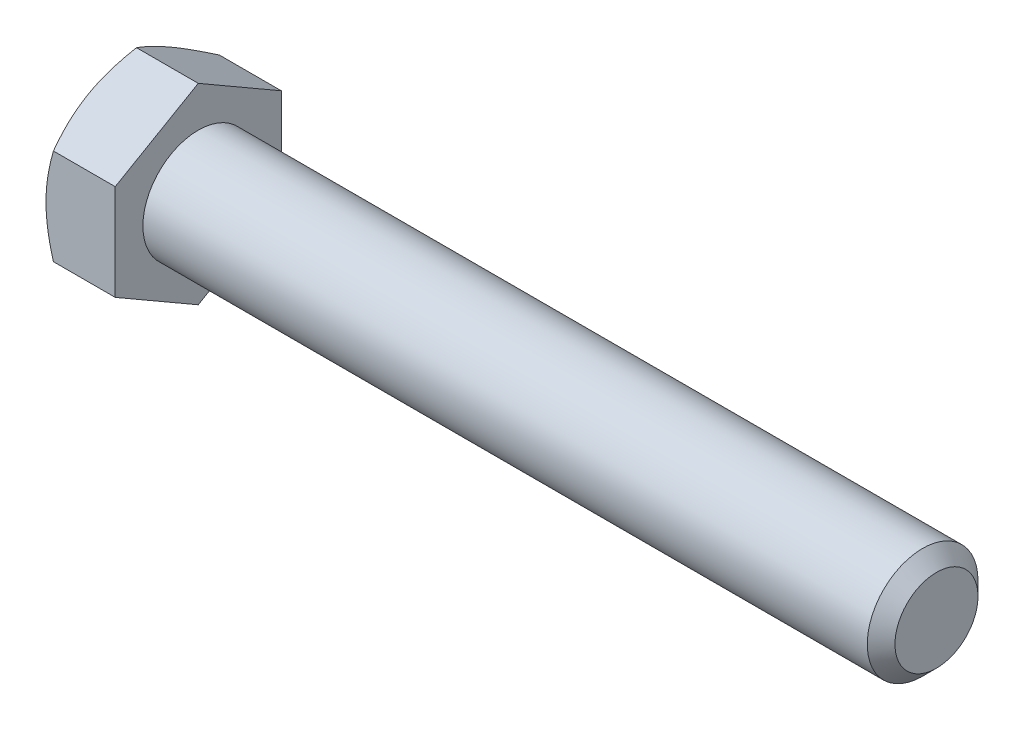
ISO-10303-21;
HEADER;
FILE_DESCRIPTION(('STEP AP214'),'2;1');
FILE_NAME('part.step','',(''),(''),'','','');
FILE_SCHEMA(('AUTOMOTIVE_DESIGN { 1 0 10303 214 1 1 1 1 }'));
ENDSEC;
DATA;
#1=APPLICATION_CONTEXT('core data for automotive mechanical design processes');
#2=APPLICATION_PROTOCOL_DEFINITION('international standard','automotive_design',2000,#1);
#3=PRODUCT_CONTEXT('',#1,'mechanical');
#4=PRODUCT('Part','Part','',(#3));
#5=PRODUCT_RELATED_PRODUCT_CATEGORY('part','',(#4));
#6=PRODUCT_DEFINITION_FORMATION('','',#4);
#7=PRODUCT_DEFINITION_CONTEXT('part definition',#1,'design');
#8=PRODUCT_DEFINITION('design','',#6,#7);
#9=PRODUCT_DEFINITION_SHAPE('','',#8);
#10=(LENGTH_UNIT() NAMED_UNIT(*) SI_UNIT(.MILLI.,.METRE.));
#11=(NAMED_UNIT(*) PLANE_ANGLE_UNIT() SI_UNIT($,.RADIAN.));
#12=(NAMED_UNIT(*) SI_UNIT($,.STERADIAN.) SOLID_ANGLE_UNIT());
#13=UNCERTAINTY_MEASURE_WITH_UNIT(LENGTH_MEASURE(1.E-05),#10,'distance_accuracy_value','');
#14=(GEOMETRIC_REPRESENTATION_CONTEXT(3) GLOBAL_UNCERTAINTY_ASSIGNED_CONTEXT((#13)) GLOBAL_UNIT_ASSIGNED_CONTEXT((#10,
#11,#12)) REPRESENTATION_CONTEXT('',''));
#15=CARTESIAN_POINT('',(0.,0.,0.));
#16=DIRECTION('',(0.,0.,1.));
#17=DIRECTION('',(1.,0.,0.));
#18=AXIS2_PLACEMENT_3D('',#15,#16,#17);
#19=CARTESIAN_POINT('',(-34.7265625,-4.12444598552339,7.14375));
#20=DIRECTION('',(0.,0.,-1.));
#21=DIRECTION('',(0.,1.,0.));
#22=AXIS2_PLACEMENT_3D('',#19,#20,#21);
#23=PLANE('',#22);
#24=CARTESIAN_POINT('',(-31.1489865517299,-11.2663331010321,7.14375000000001));
#25=CARTESIAN_POINT('',(-31.3018916093406,-10.9526585260789,7.14375000000001));
#26=CARTESIAN_POINT('',(-31.4533836933832,-10.6382836542767,7.14375000000001));
#27=CARTESIAN_POINT('',(-31.7527506821812,-10.0077615017905,7.14375000000001));
#28=CARTESIAN_POINT('',(-31.900625051226,-9.69161396702917,7.14375000000001));
#29=CARTESIAN_POINT('',(-32.1926695049596,-9.05563439196275,7.14375000000001));
#30=CARTESIAN_POINT('',(-32.3368166072603,-8.7357917628463,7.14375));
#31=CARTESIAN_POINT('',(-32.6194560800926,-8.09362699677256,7.14375));
#32=CARTESIAN_POINT('',(-32.7579487059739,-7.77130497256489,7.14375));
#33=CARTESIAN_POINT('',(-33.0323843112182,-7.1126477319264,7.14375));
#34=CARTESIAN_POINT('',(-33.1680800725103,-6.7762089572775,7.14375));
#35=CARTESIAN_POINT('',(-33.4296484442764,-6.09946617006707,7.14375));
#36=CARTESIAN_POINT('',(-33.5555199792837,-5.75916173898678,7.14375));
#37=CARTESIAN_POINT('',(-33.7942725000117,-5.07472029068008,7.14375));
#38=CARTESIAN_POINT('',(-33.9071782225713,-4.73059199311039,7.14375));
#39=CARTESIAN_POINT('',(-34.1165021446484,-4.03741473671194,7.14375));
#40=CARTESIAN_POINT('',(-34.212925341419,-3.68836730415507,7.14375));
#41=CARTESIAN_POINT('',(-34.3842652218286,-2.9870309318954,7.14375));
#42=CARTESIAN_POINT('',(-34.4593028627481,-2.63477234319657,7.14375));
#43=CARTESIAN_POINT('',(-34.5526618681374,-2.1030318667931,7.14375));
#44=CARTESIAN_POINT('',(-34.5805831510448,-1.92521461219623,7.14375));
#45=CARTESIAN_POINT('',(-34.629483904889,-1.56863481744089,7.14375));
#46=CARTESIAN_POINT('',(-34.6504640840297,-1.38987237561235,7.14375));
#47=CARTESIAN_POINT('',(-34.6847915139766,-1.03405772350562,7.14375));
#48=CARTESIAN_POINT('',(-34.698238339965,-0.857015161272195,7.14375));
#49=CARTESIAN_POINT('',(-34.7176257148482,-0.502519392820489,7.14375));
#50=CARTESIAN_POINT('',(-34.7235663937634,-0.325066193768542,7.14375));
#51=CARTESIAN_POINT('',(-34.7277989006282,0.0299339885928097,7.14375));
#52=CARTESIAN_POINT('',(-34.7260906897341,0.20748097237391,7.14375));
#53=CARTESIAN_POINT('',(-34.7150691489848,0.562340717238556,7.14375));
#54=CARTESIAN_POINT('',(-34.7057554747302,0.739653467351053,7.14375));
#55=CARTESIAN_POINT('',(-34.6748499974433,1.1601668545907,7.14375));
#56=CARTESIAN_POINT('',(-34.6499628496378,1.4031309251268,7.14375));
#57=CARTESIAN_POINT('',(-34.5872243960987,1.88736608979616,7.14375));
#58=CARTESIAN_POINT('',(-34.5493714865831,2.12863697072332,7.14375));
#59=CARTESIAN_POINT('',(-34.4183623824147,2.84956516438006,7.14375));
#60=CARTESIAN_POINT('',(-34.3077754642688,3.32610304841376,7.14375));
#61=CARTESIAN_POINT('',(-34.114565685271,4.03906159746148,7.14375));
#62=CARTESIAN_POINT('',(-34.0446450141952,4.27913814009048,7.14375));
#63=CARTESIAN_POINT('',(-33.8971844861915,4.75696290725822,7.14375));
#64=CARTESIAN_POINT('',(-33.8196445699351,4.99471111365116,7.14375));
#65=CARTESIAN_POINT('',(-33.6582190818296,5.46794997375842,7.14375));
#66=CARTESIAN_POINT('',(-33.5743352662682,5.70344123210712,7.14375));
#67=CARTESIAN_POINT('',(-33.4012445304531,6.17244640298572,7.14375));
#68=CARTESIAN_POINT('',(-33.3120377360633,6.40596036212067,7.14375));
#69=CARTESIAN_POINT('',(-33.0633604489421,7.03872191278711,7.14375));
#70=CARTESIAN_POINT('',(-32.8995400056044,7.43625841265707,7.14375));
#71=CARTESIAN_POINT('',(-32.5621568215763,8.2271912520003,7.14375));
#72=CARTESIAN_POINT('',(-32.3885929635018,8.62058711045248,7.14375));
#73=CARTESIAN_POINT('',(-32.0340472006189,9.40419829395571,7.14375));
#74=CARTESIAN_POINT('',(-31.8530623825817,9.79441229643382,7.14375));
#75=CARTESIAN_POINT('',(-31.4854644281557,10.5721508036745,7.14375));
#76=CARTESIAN_POINT('',(-31.2988515295787,10.959675421227,7.14375));
#77=CARTESIAN_POINT('',(-30.9209213608003,11.7332086856002,7.14375));
#78=CARTESIAN_POINT('',(-30.7295968603467,12.1192137923581,7.14375));
#79=CARTESIAN_POINT('',(-30.3434574990898,12.8894754248862,7.14375));
#80=CARTESIAN_POINT('',(-30.1486426081051,13.2737319355003,7.14374999999999));
#81=CARTESIAN_POINT('',(-29.7562574761783,14.040723069246,7.14374999999999));
#82=CARTESIAN_POINT('',(-29.558687874856,14.4234580199956,7.14374999999999));
#83=CARTESIAN_POINT('',(-29.1612684682255,15.1877429148004,7.14374999999999));
#84=CARTESIAN_POINT('',(-28.9614186537239,15.5692928540703,7.14374999999999));
#85=CARTESIAN_POINT('',(-28.4020884443824,16.6308245469844,7.14374999999999));
#86=CARTESIAN_POINT('',(-28.0405657253058,17.3097299401976,7.14374999999999));
#87=CARTESIAN_POINT('',(-27.313197158883,18.665271462304,7.14374999999999));
#88=CARTESIAN_POINT('',(-26.9473510371465,19.3419074436291,7.14374999999999));
#89=CARTESIAN_POINT('',(-26.2137063339653,20.6911218826658,7.14374999999999));
#90=CARTESIAN_POINT('',(-25.8459187075418,21.3637063030919,7.14374999999999));
#91=CARTESIAN_POINT('',(-25.1078891044826,22.7074568719898,7.14374999999999));
#92=CARTESIAN_POINT('',(-24.7376473290148,23.3786231309042,7.14374999999999));
#93=CARTESIAN_POINT('',(-24.3665149893366,24.0492929513685,7.14374999999999));
#94=B_SPLINE_CURVE_WITH_KNOTS('',3,(#24,#25,#26,#27,#28,#29,#30,#31,#32,#33,#34,#35,#36,#37,#38,
#39,#40,#41,#42,#43,#44,#45,#46,#47,#48,#49,#50,#51,#52,#53,#54,#55,#56,#57,#58,#59,#60,#61,#62,
#63,#64,#65,#66,#67,#68,#69,#70,#71,#72,#73,#74,#75,#76,#77,#78,#79,#80,#81,#82,#83,#84,#85,#86,
#87,#88,#89,#90,#91,#92,#93),.UNSPECIFIED.,.F.,.F.,(4,2,2,2,2,2,2,2,2,2,2,2,2,2,2,2,2,2,2,2,2,2,
2,2,2,2,2,2,2,2,2,2,2,2,4),(0.,1.04688595028014,2.09392599627377,3.14635495835938,
4.19873634125414,5.28693671898586,6.37525605639765,7.46146327925315,8.54734059411701,
9.6269484083217,10.1668224823235,10.7066414557344,11.2391458043708,11.7716409289173,
12.3041387576714,12.8366607009574,13.5689570636593,14.3013440394724,15.7668221846809,
16.516908106481,17.2669998694032,18.0168847267454,18.7667518597876,20.0564603096399,
21.3463169678315,22.6366849229971,23.926998430468,25.2194334122655,26.5118795751235,
27.8040304818266,29.0961866000085,31.4036503446529,33.7112613304689,36.0109810500031,
38.3105145356995),.UNSPECIFIED.);
#95=CARTESIAN_POINT('',(-34.0885084855234,-4.12444598552339,7.14375));
#96=VERTEX_POINT('',#95);
#97=CARTESIAN_POINT('',(-34.7265625,0.,7.14375));
#98=VERTEX_POINT('',#97);
#99=EDGE_CURVE('E252',#96,#98,#94,.T.);
#100=ORIENTED_EDGE('',*,*,#99,.F.);
#101=DIRECTION('',(1.,0.,0.));
#102=VECTOR('',#101,1.);
#103=CARTESIAN_POINT('',(-34.7265625,-4.12444598552339,7.14375));
#104=LINE('',#103,#102);
#105=CARTESIAN_POINT('',(-28.7734375,-4.12444598552339,7.14375));
#106=VERTEX_POINT('',#105);
#107=EDGE_CURVE('E255',#96,#106,#104,.T.);
#108=ORIENTED_EDGE('',*,*,#107,.T.);
#109=DIRECTION('',(0.,1.,0.));
#110=VECTOR('',#109,1.);
#111=CARTESIAN_POINT('',(-28.7734375,-4.12444598552339,7.14375));
#112=LINE('',#111,#110);
#113=CARTESIAN_POINT('',(-28.7734375,4.12444598552339,7.14375));
#114=VERTEX_POINT('',#113);
#115=EDGE_CURVE('E257',#106,#114,#112,.T.);
#116=ORIENTED_EDGE('',*,*,#115,.T.);
#117=DIRECTION('',(1.,0.,0.));
#118=VECTOR('',#117,1.);
#119=CARTESIAN_POINT('',(-34.7265625,4.12444598552339,7.14375));
#120=LINE('',#119,#118);
#121=CARTESIAN_POINT('',(-34.0885084855234,4.12444598552339,7.14375));
#122=VERTEX_POINT('',#121);
#123=EDGE_CURVE('E225',#122,#114,#120,.T.);
#124=ORIENTED_EDGE('',*,*,#123,.F.);
#125=EDGE_CURVE('E109',#98,#122,#94,.T.);
#126=ORIENTED_EDGE('',*,*,#125,.F.);
#127=EDGE_LOOP('',(#100,#108,#116,#124,#126));
#128=FACE_BOUND('',#127,.T.);
#129=ADVANCED_FACE('F33',(#128),#23,.F.);
#130=CARTESIAN_POINT('',(-34.7265625,4.12444598552339,7.14375));
#131=DIRECTION('',(0.,-0.866025403784439,-0.5));
#132=DIRECTION('',(0.,0.5,-0.866025403784439));
#133=AXIS2_PLACEMENT_3D('',#130,#131,#132);
#134=PLANE('',#133);
#135=CARTESIAN_POINT('',(-34.0884418174569,4.12433051546955,7.14395));
#136=CARTESIAN_POINT('',(-34.14077646855,4.21499047493766,6.98692234398911));
#137=CARTESIAN_POINT('',(-34.1907359741408,4.30598845856223,6.82930921296503));
#138=CARTESIAN_POINT('',(-34.2852505324684,4.48872342670425,6.51280296382357));
#139=CARTESIAN_POINT('',(-34.3298032537979,4.58046071195489,6.35390932482102));
#140=CARTESIAN_POINT('',(-34.4544767378888,4.85714139103217,5.87468433118651));
#141=CARTESIAN_POINT('',(-34.5253895900442,5.04317693592539,5.55246131541769));
#142=CARTESIAN_POINT('',(-34.6085432614031,5.32157574305278,5.07026043670648));
#143=CARTESIAN_POINT('',(-34.6322313344435,5.41310718327031,4.91172333175978));
#144=CARTESIAN_POINT('',(-34.6719527768645,5.59658364372469,4.59393278025988));
#145=CARTESIAN_POINT('',(-34.6879868225755,5.6885286266948,4.4346793982546));
#146=CARTESIAN_POINT('',(-34.711991577991,5.87257827929426,4.11589604883692));
#147=CARTESIAN_POINT('',(-34.7199714385863,5.96468264833057,3.95636660206697));
#148=CARTESIAN_POINT('',(-34.7277052757077,6.14897138013525,3.63716915531883));
#149=CARTESIAN_POINT('',(-34.7274595063572,6.24115574034439,3.47750115977338));
#150=CARTESIAN_POINT('',(-34.7154795896088,6.49371006632156,3.04006423550959));
#151=CARTESIAN_POINT('',(-34.695368878855,6.65399735752975,2.76243850332943));
#152=CARTESIAN_POINT('',(-34.631597993257,6.97350732659354,2.20903100338617));
#153=CARTESIAN_POINT('',(-34.5879160225342,7.13272888080875,1.93325118182535));
#154=CARTESIAN_POINT('',(-34.4787239095432,7.45288184700058,1.37872997818721));
#155=CARTESIAN_POINT('',(-34.4127511381118,7.61377286233254,1.10005856515092));
#156=CARTESIAN_POINT('',(-34.2630196178419,7.93315557291967,0.546871483354956));
#157=CARTESIAN_POINT('',(-34.1792960396244,8.09165135831551,0.272348730263811));
#158=CARTESIAN_POINT('',(-34.0884418174569,8.24900744110062,-0.000200000000000877));
#159=B_SPLINE_CURVE_WITH_KNOTS('',3,(#135,#136,#137,#138,#139,#140,#141,#142,#143,#144,#145,
#146,#147,#148,#149,#150,#151,#152,#153,#154,#155,#156,#157,#158),.UNSPECIFIED.,.F.,.F.,(4,2,2,
2,2,2,2,2,2,2,2,4),(0.,0.566119481838006,1.13248221371019,2.2675610579816,2.82119915823017,
3.37478832846408,3.92774781910558,4.48069022658465,5.44329448766884,6.4067903790172,
7.39165514483023,8.37458648302853),.UNSPECIFIED.);
#160=CARTESIAN_POINT('',(-34.7265625,6.18666897828508,3.571875));
#161=VERTEX_POINT('',#160);
#162=EDGE_CURVE('E105',#122,#161,#159,.T.);
#163=ORIENTED_EDGE('',*,*,#162,.F.);
#164=ORIENTED_EDGE('',*,*,#123,.T.);
#165=DIRECTION('',(0.,0.5,-0.866025403784439));
#166=VECTOR('',#165,1.);
#167=CARTESIAN_POINT('',(-28.7734375,4.12444598552339,7.14375));
#168=LINE('',#167,#166);
#169=CARTESIAN_POINT('',(-28.7734375,8.24889197104678,0.));
#170=VERTEX_POINT('',#169);
#171=EDGE_CURVE('E275',#114,#170,#168,.T.);
#172=ORIENTED_EDGE('',*,*,#171,.T.);
#173=DIRECTION('',(1.,0.,0.));
#174=VECTOR('',#173,1.);
#175=CARTESIAN_POINT('',(-34.7265625,8.24889197104678,0.));
#176=LINE('',#175,#174);
#177=CARTESIAN_POINT('',(-34.0885084855234,8.24889197104678,0.));
#178=VERTEX_POINT('',#177);
#179=EDGE_CURVE('E128',#178,#170,#176,.T.);
#180=ORIENTED_EDGE('',*,*,#179,.F.);
#181=EDGE_CURVE('E113',#161,#178,#159,.T.);
#182=ORIENTED_EDGE('',*,*,#181,.F.);
#183=EDGE_LOOP('',(#163,#164,#172,#180,#182));
#184=FACE_BOUND('',#183,.T.);
#185=ADVANCED_FACE('F126',(#184),#134,.F.);
#186=CARTESIAN_POINT('',(-34.7265625,8.24889197104678,0.));
#187=DIRECTION('',(0.,-0.866025403784439,0.5));
#188=DIRECTION('',(0.,-0.5,-0.866025403784439));
#189=AXIS2_PLACEMENT_3D('',#186,#187,#188);
#190=PLANE('',#189);
#191=CARTESIAN_POINT('',(-34.0884418174569,8.24900744110062,0.000199999999999568));
#192=CARTESIAN_POINT('',(-34.14077646855,8.15834748163251,-0.156827656010893));
#193=CARTESIAN_POINT('',(-34.1907359741408,8.06734949800794,-0.314440787034966));
#194=CARTESIAN_POINT('',(-34.2852505324684,7.88461452986592,-0.630947036176425));
#195=CARTESIAN_POINT('',(-34.3298032537979,7.79287724461528,-0.789840675178983));
#196=CARTESIAN_POINT('',(-34.4544767378888,7.516196565538,-1.26906566881349));
#197=CARTESIAN_POINT('',(-34.5253895900442,7.33016102064478,-1.59128868458231));
#198=CARTESIAN_POINT('',(-34.6085432614031,7.05176221351739,-2.07348956329352));
#199=CARTESIAN_POINT('',(-34.6322313344435,6.96023077329986,-2.23202666824022));
#200=CARTESIAN_POINT('',(-34.6719527768645,6.77675431284548,-2.54981721974012));
#201=CARTESIAN_POINT('',(-34.6879868225755,6.68480932987537,-2.7090706017454));
#202=CARTESIAN_POINT('',(-34.711991577991,6.50075967727591,-3.02785395116308));
#203=CARTESIAN_POINT('',(-34.7199714385863,6.4086553082396,-3.18738339793303));
#204=CARTESIAN_POINT('',(-34.7277052757077,6.22436657643492,-3.50658084468117));
#205=CARTESIAN_POINT('',(-34.7274595063572,6.13218221622578,-3.66624884022662));
#206=CARTESIAN_POINT('',(-34.7154795896088,5.87962789024861,-4.10368576449041));
#207=CARTESIAN_POINT('',(-34.695368878855,5.71934059904042,-4.38131149667057));
#208=CARTESIAN_POINT('',(-34.631597993257,5.39983062997663,-4.93471899661383));
#209=CARTESIAN_POINT('',(-34.5879160225342,5.24060907576142,-5.21049881817465));
#210=CARTESIAN_POINT('',(-34.4787239095432,4.92045610956958,-5.76502002181279));
#211=CARTESIAN_POINT('',(-34.4127511381118,4.75956509423763,-6.04369143484908));
#212=CARTESIAN_POINT('',(-34.2630196178419,4.4401823836505,-6.59687851664504));
#213=CARTESIAN_POINT('',(-34.1792960396244,4.28168659825465,-6.87140126973619));
#214=CARTESIAN_POINT('',(-34.0884418174569,4.12433051546955,-7.14395));
#215=B_SPLINE_CURVE_WITH_KNOTS('',3,(#191,#192,#193,#194,#195,#196,#197,#198,#199,#200,#201,
#202,#203,#204,#205,#206,#207,#208,#209,#210,#211,#212,#213,#214),.UNSPECIFIED.,.F.,.F.,(4,2,2,
2,2,2,2,2,2,2,2,4),(0.,0.566119481838006,1.13248221371019,2.2675610579816,2.82119915823017,
3.37478832846408,3.92774781910558,4.48069022658465,5.44329448766884,6.4067903790172,
7.39165514483023,8.37458648302854),.UNSPECIFIED.);
#216=CARTESIAN_POINT('',(-34.7265625,6.18666897828508,-3.571875));
#217=VERTEX_POINT('',#216);
#218=EDGE_CURVE('E118',#178,#217,#215,.T.);
#219=ORIENTED_EDGE('',*,*,#218,.F.);
#220=ORIENTED_EDGE('',*,*,#179,.T.);
#221=DIRECTION('',(0.,-0.5,-0.866025403784439));
#222=VECTOR('',#221,1.);
#223=CARTESIAN_POINT('',(-28.7734375,8.24889197104678,0.));
#224=LINE('',#223,#222);
#225=CARTESIAN_POINT('',(-28.7734375,4.12444598552339,-7.14375));
#226=VERTEX_POINT('',#225);
#227=EDGE_CURVE('E272',#170,#226,#224,.T.);
#228=ORIENTED_EDGE('',*,*,#227,.T.);
#229=DIRECTION('',(1.,0.,0.));
#230=VECTOR('',#229,1.);
#231=CARTESIAN_POINT('',(-34.7265625,4.12444598552339,-7.14375));
#232=LINE('',#231,#230);
#233=CARTESIAN_POINT('',(-34.0885084855234,4.12444598552339,-7.14375));
#234=VERTEX_POINT('',#233);
#235=EDGE_CURVE('E269',#234,#226,#232,.T.);
#236=ORIENTED_EDGE('',*,*,#235,.F.);
#237=EDGE_CURVE('E129',#217,#234,#215,.T.);
#238=ORIENTED_EDGE('',*,*,#237,.F.);
#239=EDGE_LOOP('',(#219,#220,#228,#236,#238));
#240=FACE_BOUND('',#239,.T.);
#241=ADVANCED_FACE('F189',(#240),#190,.F.);
#242=CARTESIAN_POINT('',(-34.7265625,4.12444598552339,-7.14375));
#243=DIRECTION('',(0.,0.,1.));
#244=DIRECTION('',(0.,-1.,0.));
#245=AXIS2_PLACEMENT_3D('',#242,#243,#244);
#246=PLANE('',#245);
#247=CARTESIAN_POINT('',(-31.1489865559728,-11.2663330923302,-7.14375));
#248=CARTESIAN_POINT('',(-31.3018916134069,-10.95265851767,-7.14375));
#249=CARTESIAN_POINT('',(-31.4533836972729,-10.6382836461611,-7.14375));
#250=CARTESIAN_POINT('',(-31.7527506857185,-10.0077614942623,-7.14375));
#251=CARTESIAN_POINT('',(-31.9006250545876,-9.69161395979511,-7.14375));
#252=CARTESIAN_POINT('',(-32.1926695079696,-9.05563438532138,-7.14375));
#253=CARTESIAN_POINT('',(-32.3368166100945,-8.73579175650347,-7.14375));
#254=CARTESIAN_POINT('',(-32.6194560825781,-8.09362699102884,-7.14375));
#255=CARTESIAN_POINT('',(-32.7579487082865,-7.77130496712173,-7.14375));
#256=CARTESIAN_POINT('',(-33.0323843131795,-7.11264772710838,-7.14375));
#257=CARTESIAN_POINT('',(-33.1680800742936,-6.77620895278427,-7.14375));
#258=CARTESIAN_POINT('',(-33.4296484457133,-6.09946616622859,-7.14375));
#259=CARTESIAN_POINT('',(-33.555519980552,-5.75916173547825,-7.14375));
#260=CARTESIAN_POINT('',(-33.7942725009588,-5.07472028783757,-7.14375));
#261=CARTESIAN_POINT('',(-33.9071782233658,-4.73059199060391,-7.14375));
#262=CARTESIAN_POINT('',(-34.1165021451621,-4.03741473488657,-7.14375));
#263=CARTESIAN_POINT('',(-34.2129253418045,-3.68836730267476,-7.14375));
#264=CARTESIAN_POINT('',(-34.3842652219552,-2.98703093128028,-7.14375));
#265=CARTESIAN_POINT('',(-34.4593028627536,-2.63477234310399,-7.14375));
#266=CARTESIAN_POINT('',(-34.5526618680198,-2.10303186749372,-7.14375));
#267=CARTESIAN_POINT('',(-34.5805831508959,-1.92521461316273,-7.14375));
#268=CARTESIAN_POINT('',(-34.6294839046995,-1.56863481894147,-7.14375));
#269=CARTESIAN_POINT('',(-34.6504640838307,-1.38987237738114,-7.14375));
#270=CARTESIAN_POINT('',(-34.6847915137826,-1.03405772580524,-7.14375));
#271=CARTESIAN_POINT('',(-34.698238339785,-0.857015163834411,-7.14375));
#272=CARTESIAN_POINT('',(-34.7176257147193,-0.502519395907492,-7.14375));
#273=CARTESIAN_POINT('',(-34.7235663936717,-0.325066197117733,-7.14375));
#274=CARTESIAN_POINT('',(-34.7277989006338,0.0299339847211313,-7.14375));
#275=CARTESIAN_POINT('',(-34.7260906897997,0.207480968241932,-7.14375));
#276=CARTESIAN_POINT('',(-34.7150691491919,0.562340712589318,-7.14375));
#277=CARTESIAN_POINT('',(-34.7057554750187,0.739653462444853,-7.14375));
#278=CARTESIAN_POINT('',(-34.6748499979318,1.16016684929156,-7.14375));
#279=CARTESIAN_POINT('',(-34.6499628502411,1.40313091969279,-7.14375));
#280=CARTESIAN_POINT('',(-34.5872243969377,1.88736608409862,-7.14375));
#281=CARTESIAN_POINT('',(-34.5493714875431,2.12863696489713,-7.14375));
#282=CARTESIAN_POINT('',(-34.4183623837398,2.84956515817507,-7.14375));
#283=CARTESIAN_POINT('',(-34.3077754658405,3.32610304196642,-7.14375));
#284=CARTESIAN_POINT('',(-34.1145656872064,4.03906159065169,-7.14375));
#285=CARTESIAN_POINT('',(-34.0446450162526,4.27913813315721,-7.14375));
#286=CARTESIAN_POINT('',(-33.8971844884891,4.75696290007943,-7.14375));
#287=CARTESIAN_POINT('',(-33.8196445723509,4.99471110635033,-7.14375));
#288=CARTESIAN_POINT('',(-33.6582190844775,5.46794996621446,-7.14375));
#289=CARTESIAN_POINT('',(-33.57433526903,5.70344122444206,-7.14375));
#290=CARTESIAN_POINT('',(-33.4012445334384,6.17244639507845,-7.14375));
#291=CARTESIAN_POINT('',(-33.3120377391583,6.40596035409229,-7.14375));
#292=CARTESIAN_POINT('',(-33.0633604522274,7.03872190469163,-7.14375));
#293=CARTESIAN_POINT('',(-32.8995400089579,7.43625840461189,-7.14375));
#294=CARTESIAN_POINT('',(-32.5621568250461,8.22719124404919,-7.14375));
#295=CARTESIAN_POINT('',(-32.3885929670198,8.62058710254515,-7.14375));
#296=CARTESIAN_POINT('',(-32.0340472042188,9.40419828613123,-7.14375));
#297=CARTESIAN_POINT('',(-31.8530623862153,9.79441228864843,-7.14375));
#298=CARTESIAN_POINT('',(-31.4854644318466,10.5721507959631,-7.14375));
#299=CARTESIAN_POINT('',(-31.2988515332932,10.9596754135504,-7.14375));
#300=CARTESIAN_POINT('',(-30.9209213645535,11.7332086779923,-7.14375));
#301=CARTESIAN_POINT('',(-30.729596864115,12.119213784784,-7.14375));
#302=CARTESIAN_POINT('',(-30.3434575028827,12.8894754173773,-7.14375));
#303=CARTESIAN_POINT('',(-30.1486426119076,13.2737319280228,-7.14375));
#304=CARTESIAN_POINT('',(-29.7562574799958,14.0407230618289,-7.14375));
#305=CARTESIAN_POINT('',(-29.5586878786791,14.4234580126074,-7.14375000000001));
#306=CARTESIAN_POINT('',(-29.1612684720565,15.1877429074688,-7.14375000000001));
#307=CARTESIAN_POINT('',(-28.9614186575573,15.5692928467661,-7.14375000000001));
#308=CARTESIAN_POINT('',(-28.4020884482434,16.6308245397088,-7.14375000000001));
#309=CARTESIAN_POINT('',(-28.0405657291898,17.309729932922,-7.14375000000001));
#310=CARTESIAN_POINT('',(-27.3131971628082,18.6652714550261,-7.14375000000001));
#311=CARTESIAN_POINT('',(-26.94735104109,19.341907436349,-7.14375000000001));
#312=CARTESIAN_POINT('',(-26.2137063379465,20.6911218753718,-7.14375000000001));
#313=CARTESIAN_POINT('',(-25.8459187115425,21.3637062957861,-7.14375000000001));
#314=CARTESIAN_POINT('',(-25.1078891085202,22.7074568646593,-7.14375000000001));
#315=CARTESIAN_POINT('',(-24.7376473330699,23.3786231235606,-7.14375000000001));
#316=CARTESIAN_POINT('',(-24.3665149934083,24.0492929440113,-7.14375000000001));
#317=B_SPLINE_CURVE_WITH_KNOTS('',3,(#247,#248,#249,#250,#251,#252,#253,#254,#255,#256,#257,
#258,#259,#260,#261,#262,#263,#264,#265,#266,#267,#268,#269,#270,#271,#272,#273,#274,#275,#276,
#277,#278,#279,#280,#281,#282,#283,#284,#285,#286,#287,#288,#289,#290,#291,#292,#293,#294,#295,
#296,#297,#298,#299,#300,#301,#302,#303,#304,#305,#306,#307,#308,#309,#310,#311,#312,#313,#314,
#315,#316),.UNSPECIFIED.,.F.,.F.,(4,2,2,2,2,2,2,2,2,2,2,2,2,2,2,2,2,2,2,2,2,2,2,2,2,2,2,2,2,2,2,
2,2,2,4),(0.,1.04688594925758,2.0939259942285,3.14635495528084,4.19873633714242,
5.28693671377091,6.37525605007911,7.46146327183454,8.54734058559918,9.62694839819883,
10.1668224713986,10.7066414440079,11.2391457918626,11.7716409156275,12.3041387435997,
12.8366606861037,13.5689570483682,14.3013440237439,15.7668221680756,16.5169080894175,
17.2669998518816,18.0168847087668,18.766751841352,20.056460291265,21.3463169495181,
22.6366849047474,23.9269984122816,25.2194333941499,26.5118795570788,27.8040304638516,
29.0961865821031,31.4036503267151,33.7112613124992,36.0109810319745,38.3105145176112),.UNSPECIFIED.);
#318=CARTESIAN_POINT('',(-34.7265625,0.,-7.14375));
#319=VERTEX_POINT('',#318);
#320=EDGE_CURVE('E183',#234,#319,#317,.F.);
#321=ORIENTED_EDGE('',*,*,#320,.F.);
#322=ORIENTED_EDGE('',*,*,#235,.T.);
#323=DIRECTION('',(0.,-1.,0.));
#324=VECTOR('',#323,1.);
#325=CARTESIAN_POINT('',(-28.7734375,4.12444598552339,-7.14375));
#326=LINE('',#325,#324);
#327=CARTESIAN_POINT('',(-28.7734375,-4.12444598552339,-7.14375));
#328=VERTEX_POINT('',#327);
#329=EDGE_CURVE('E279',#226,#328,#326,.T.);
#330=ORIENTED_EDGE('',*,*,#329,.T.);
#331=DIRECTION('',(1.,0.,0.));
#332=VECTOR('',#331,1.);
#333=CARTESIAN_POINT('',(-34.7265625,-4.12444598552339,-7.14375));
#334=LINE('',#333,#332);
#335=CARTESIAN_POINT('',(-34.0885084855234,-4.12444598552339,-7.14375));
#336=VERTEX_POINT('',#335);
#337=EDGE_CURVE('E240',#336,#328,#334,.T.);
#338=ORIENTED_EDGE('',*,*,#337,.F.);
#339=EDGE_CURVE('E177',#319,#336,#317,.F.);
#340=ORIENTED_EDGE('',*,*,#339,.F.);
#341=EDGE_LOOP('',(#321,#322,#330,#338,#340));
#342=FACE_BOUND('',#341,.T.);
#343=ADVANCED_FACE('F185',(#342),#246,.F.);
#344=CARTESIAN_POINT('',(-34.7265625,-4.12444598552339,-7.14375));
#345=DIRECTION('',(0.,0.866025403784439,0.5));
#346=DIRECTION('',(0.,-0.5,0.866025403784439));
#347=AXIS2_PLACEMENT_3D('',#344,#345,#346);
#348=PLANE('',#347);
#349=CARTESIAN_POINT('',(-34.0884418174569,-4.12433051546955,-7.14395));
#350=CARTESIAN_POINT('',(-34.14077646855,-4.21499047493766,-6.98692234398911));
#351=CARTESIAN_POINT('',(-34.1907359741408,-4.30598845856223,-6.82930921296503));
#352=CARTESIAN_POINT('',(-34.2852505324684,-4.48872342670425,-6.51280296382357));
#353=CARTESIAN_POINT('',(-34.3298032537979,-4.58046071195489,-6.35390932482102));
#354=CARTESIAN_POINT('',(-34.4544767378888,-4.85714139103217,-5.87468433118651));
#355=CARTESIAN_POINT('',(-34.5253895900442,-5.04317693592539,-5.55246131541769));
#356=CARTESIAN_POINT('',(-34.6085432614031,-5.32157574305278,-5.07026043670648));
#357=CARTESIAN_POINT('',(-34.6322313344435,-5.41310718327031,-4.91172333175978));
#358=CARTESIAN_POINT('',(-34.6719527768645,-5.59658364372469,-4.59393278025988));
#359=CARTESIAN_POINT('',(-34.6879868225755,-5.6885286266948,-4.43467939825459));
#360=CARTESIAN_POINT('',(-34.711991577991,-5.87257827929427,-4.11589604883692));
#361=CARTESIAN_POINT('',(-34.7199714385863,-5.96468264833057,-3.95636660206697));
#362=CARTESIAN_POINT('',(-34.7277052757077,-6.14897138013525,-3.63716915531883));
#363=CARTESIAN_POINT('',(-34.7274595063572,-6.24115574034439,-3.47750115977337));
#364=CARTESIAN_POINT('',(-34.7154795896088,-6.49371006632156,-3.04006423550959));
#365=CARTESIAN_POINT('',(-34.695368878855,-6.65399735752975,-2.76243850332943));
#366=CARTESIAN_POINT('',(-34.631597993257,-6.97350732659354,-2.20903100338617));
#367=CARTESIAN_POINT('',(-34.5879160225342,-7.13272888080875,-1.93325118182535));
#368=CARTESIAN_POINT('',(-34.4787239095432,-7.45288184700059,-1.37872997818721));
#369=CARTESIAN_POINT('',(-34.4127511381118,-7.61377286233254,-1.10005856515092));
#370=CARTESIAN_POINT('',(-34.2630196178419,-7.93315557291967,-0.546871483354957));
#371=CARTESIAN_POINT('',(-34.1792960396244,-8.09165135831551,-0.272348730263812));
#372=CARTESIAN_POINT('',(-34.0884418174569,-8.24900744110062,0.000199999999998456));
#373=B_SPLINE_CURVE_WITH_KNOTS('',3,(#349,#350,#351,#352,#353,#354,#355,#356,#357,#358,#359,
#360,#361,#362,#363,#364,#365,#366,#367,#368,#369,#370,#371,#372),.UNSPECIFIED.,.F.,.F.,(4,2,2,
2,2,2,2,2,2,2,2,4),(0.,0.566119481838006,1.13248221371019,2.2675610579816,2.82119915823017,
3.37478832846408,3.92774781910558,4.48069022658465,5.44329448766884,6.4067903790172,
7.39165514483023,8.37458648302853),.UNSPECIFIED.);
#374=CARTESIAN_POINT('',(-34.7265625,-6.18666897828508,-3.571875));
#375=VERTEX_POINT('',#374);
#376=EDGE_CURVE('E184',#336,#375,#373,.T.);
#377=ORIENTED_EDGE('',*,*,#376,.F.);
#378=ORIENTED_EDGE('',*,*,#337,.T.);
#379=DIRECTION('',(0.,-0.5,0.866025403784439));
#380=VECTOR('',#379,1.);
#381=CARTESIAN_POINT('',(-28.7734375,-4.12444598552339,-7.14375));
#382=LINE('',#381,#380);
#383=CARTESIAN_POINT('',(-28.7734375,-8.24889197104678,0.));
#384=VERTEX_POINT('',#383);
#385=EDGE_CURVE('E264',#328,#384,#382,.T.);
#386=ORIENTED_EDGE('',*,*,#385,.T.);
#387=DIRECTION('',(1.,0.,0.));
#388=VECTOR('',#387,1.);
#389=CARTESIAN_POINT('',(-34.7265625,-8.24889197104678,0.));
#390=LINE('',#389,#388);
#391=CARTESIAN_POINT('',(-34.0885084855234,-8.24889197104678,0.));
#392=VERTEX_POINT('',#391);
#393=EDGE_CURVE('E261',#392,#384,#390,.T.);
#394=ORIENTED_EDGE('',*,*,#393,.F.);
#395=EDGE_CURVE('E171',#375,#392,#373,.T.);
#396=ORIENTED_EDGE('',*,*,#395,.F.);
#397=EDGE_LOOP('',(#377,#378,#386,#394,#396));
#398=FACE_BOUND('',#397,.T.);
#399=ADVANCED_FACE('F188',(#398),#348,.F.);
#400=CARTESIAN_POINT('',(-34.7265625,-8.24889197104678,0.));
#401=DIRECTION('',(0.,0.866025403784439,-0.5));
#402=DIRECTION('',(0.,0.5,0.866025403784439));
#403=AXIS2_PLACEMENT_3D('',#400,#401,#402);
#404=PLANE('',#403);
#405=CARTESIAN_POINT('',(-34.0884418174569,-8.24900744110062,-0.00020000000000139));
#406=CARTESIAN_POINT('',(-34.14077646855,-8.15834748163251,0.156827656010891));
#407=CARTESIAN_POINT('',(-34.1907359741408,-8.06734949800794,0.314440787034964));
#408=CARTESIAN_POINT('',(-34.2852505324684,-7.88461452986592,0.630947036176423));
#409=CARTESIAN_POINT('',(-34.3298032537979,-7.79287724461528,0.789840675178981));
#410=CARTESIAN_POINT('',(-34.4544767378888,-7.516196565538,1.26906566881349));
#411=CARTESIAN_POINT('',(-34.5253895900442,-7.33016102064478,1.59128868458231));
#412=CARTESIAN_POINT('',(-34.6085432614031,-7.05176221351739,2.07348956329352));
#413=CARTESIAN_POINT('',(-34.6322313344435,-6.96023077329986,2.23202666824022));
#414=CARTESIAN_POINT('',(-34.6719527768645,-6.77675431284548,2.54981721974012));
#415=CARTESIAN_POINT('',(-34.6879868225755,-6.68480932987537,2.7090706017454));
#416=CARTESIAN_POINT('',(-34.711991577991,-6.50075967727591,3.02785395116307));
#417=CARTESIAN_POINT('',(-34.7199714385863,-6.4086553082396,3.18738339793303));
#418=CARTESIAN_POINT('',(-34.7277052757077,-6.22436657643492,3.50658084468117));
#419=CARTESIAN_POINT('',(-34.7274595063572,-6.13218221622579,3.66624884022662));
#420=CARTESIAN_POINT('',(-34.7154795896088,-5.87962789024861,4.10368576449041));
#421=CARTESIAN_POINT('',(-34.695368878855,-5.71934059904042,4.38131149667057));
#422=CARTESIAN_POINT('',(-34.631597993257,-5.39983062997663,4.93471899661383));
#423=CARTESIAN_POINT('',(-34.5879160225342,-5.24060907576142,5.21049881817465));
#424=CARTESIAN_POINT('',(-34.4787239095432,-4.92045610956959,5.76502002181279));
#425=CARTESIAN_POINT('',(-34.4127511381118,-4.75956509423763,6.04369143484908));
#426=CARTESIAN_POINT('',(-34.2630196178419,-4.44018238365051,6.59687851664505));
#427=CARTESIAN_POINT('',(-34.1792960396244,-4.28168659825466,6.87140126973619));
#428=CARTESIAN_POINT('',(-34.0884418174569,-4.12433051546955,7.14395));
#429=B_SPLINE_CURVE_WITH_KNOTS('',3,(#405,#406,#407,#408,#409,#410,#411,#412,#413,#414,#415,
#416,#417,#418,#419,#420,#421,#422,#423,#424,#425,#426,#427,#428),.UNSPECIFIED.,.F.,.F.,(4,2,2,
2,2,2,2,2,2,2,2,4),(0.,0.566119481838006,1.13248221371019,2.2675610579816,2.82119915823017,
3.37478832846408,3.92774781910558,4.48069022658465,5.44329448766884,6.4067903790172,
7.39165514483023,8.37458648302854),.UNSPECIFIED.);
#430=CARTESIAN_POINT('',(-34.7265625,-6.18666897828508,3.571875));
#431=VERTEX_POINT('',#430);
#432=EDGE_CURVE('E247',#392,#431,#429,.T.);
#433=ORIENTED_EDGE('',*,*,#432,.F.);
#434=ORIENTED_EDGE('',*,*,#393,.T.);
#435=DIRECTION('',(0.,0.5,0.866025403784439));
#436=VECTOR('',#435,1.);
#437=CARTESIAN_POINT('',(-28.7734375,-8.24889197104678,0.));
#438=LINE('',#437,#436);
#439=EDGE_CURVE('E259',#384,#106,#438,.T.);
#440=ORIENTED_EDGE('',*,*,#439,.T.);
#441=ORIENTED_EDGE('',*,*,#107,.F.);
#442=EDGE_CURVE('E123',#431,#96,#429,.T.);
#443=ORIENTED_EDGE('',*,*,#442,.F.);
#444=EDGE_LOOP('',(#433,#434,#440,#441,#443));
#445=FACE_BOUND('',#444,.T.);
#446=ADVANCED_FACE('F210',(#445),#404,.F.);
#447=CARTESIAN_POINT('',(-28.7734375,0.,0.));
#448=DIRECTION('',(1.,0.,0.));
#449=DIRECTION('',(0.,0.,-1.));
#450=AXIS2_PLACEMENT_3D('',#447,#448,#449);
#451=CYLINDRICAL_SURFACE('',#450,4.7625);
#452=CARTESIAN_POINT('',(33.5359375,0.,0.));
#453=DIRECTION('',(1.,0.,0.));
#454=DIRECTION('',(0.,0.,-1.));
#455=AXIS2_PLACEMENT_3D('',#452,#453,#454);
#456=CIRCLE('',#455,4.7625);
#457=CARTESIAN_POINT('',(33.5359375,0.,-4.7625));
#458=VERTEX_POINT('',#457);
#459=EDGE_CURVE('E219',#458,#458,#456,.F.);
#460=ORIENTED_EDGE('',*,*,#459,.T.);
#461=EDGE_LOOP('',(#460));
#462=FACE_BOUND('',#461,.T.);
#463=CARTESIAN_POINT('',(-28.7734375,0.,0.));
#464=DIRECTION('',(-1.,0.,0.));
#465=DIRECTION('',(0.,0.,1.));
#466=AXIS2_PLACEMENT_3D('',#463,#464,#465);
#467=CIRCLE('',#466,4.7625);
#468=CARTESIAN_POINT('',(-28.7734375,0.,4.7625));
#469=VERTEX_POINT('',#468);
#470=EDGE_CURVE('E222',#469,#469,#467,.F.);
#471=ORIENTED_EDGE('',*,*,#470,.T.);
#472=EDGE_LOOP('',(#471));
#473=FACE_BOUND('',#472,.T.);
#474=ADVANCED_FACE('F207',(#462,#473),#451,.T.);
#475=CARTESIAN_POINT('',(34.7265625,0.,0.));
#476=DIRECTION('',(1.,0.,0.));
#477=DIRECTION('',(0.,0.,-1.));
#478=AXIS2_PLACEMENT_3D('',#475,#476,#477);
#479=PLANE('',#478);
#480=CARTESIAN_POINT('',(34.7265625,0.,0.));
#481=DIRECTION('',(1.,0.,0.));
#482=DIRECTION('',(0.,0.,-1.));
#483=AXIS2_PLACEMENT_3D('',#480,#481,#482);
#484=CIRCLE('',#483,3.571875);
#485=CARTESIAN_POINT('',(34.7265625,0.,-3.571875));
#486=VERTEX_POINT('',#485);
#487=EDGE_CURVE('E224',#486,#486,#484,.T.);
#488=ORIENTED_EDGE('',*,*,#487,.T.);
#489=EDGE_LOOP('',(#488));
#490=FACE_BOUND('',#489,.T.);
#491=ADVANCED_FACE('F205',(#490),#479,.T.);
#492=CARTESIAN_POINT('',(34.7265625,0.,0.));
#493=DIRECTION('',(-1.,0.,0.));
#494=DIRECTION('',(0.,0.,1.));
#495=AXIS2_PLACEMENT_3D('',#492,#493,#494);
#496=CONICAL_SURFACE('',#495,3.571875,0.78539816339745);
#497=ORIENTED_EDGE('',*,*,#459,.F.);
#498=EDGE_LOOP('',(#497));
#499=FACE_BOUND('',#498,.T.);
#500=ORIENTED_EDGE('',*,*,#487,.F.);
#501=EDGE_LOOP('',(#500));
#502=FACE_BOUND('',#501,.T.);
#503=ADVANCED_FACE('F35',(#499,#502),#496,.T.);
#504=CARTESIAN_POINT('',(-28.7734375,4.12444598552339,7.14375));
#505=DIRECTION('',(-1.,0.,0.));
#506=DIRECTION('',(0.,0.,1.));
#507=AXIS2_PLACEMENT_3D('',#504,#505,#506);
#508=PLANE('',#507);
#509=ORIENTED_EDGE('',*,*,#470,.F.);
#510=EDGE_LOOP('',(#509));
#511=FACE_BOUND('',#510,.T.);
#512=ORIENTED_EDGE('',*,*,#115,.F.);
#513=ORIENTED_EDGE('',*,*,#439,.F.);
#514=ORIENTED_EDGE('',*,*,#385,.F.);
#515=ORIENTED_EDGE('',*,*,#329,.F.);
#516=ORIENTED_EDGE('',*,*,#227,.F.);
#517=ORIENTED_EDGE('',*,*,#171,.F.);
#518=EDGE_LOOP('',(#512,#513,#514,#515,#516,#517));
#519=FACE_BOUND('',#518,.T.);
#520=ADVANCED_FACE('F156',(#511,#519),#508,.F.);
#521=CARTESIAN_POINT('',(-34.7265625,0.,0.));
#522=DIRECTION('',(1.,0.,0.));
#523=DIRECTION('',(0.,0.,1.));
#524=AXIS2_PLACEMENT_3D('',#521,#522,#523);
#525=CONICAL_SURFACE('',#524,7.14375,1.0471975511966);
#526=ORIENTED_EDGE('',*,*,#99,.T.);
#527=CARTESIAN_POINT('',(-34.7265625,0.,0.));
#528=DIRECTION('',(-1.,0.,0.));
#529=DIRECTION('',(0.,0.,1.));
#530=AXIS2_PLACEMENT_3D('',#527,#528,#529);
#531=CIRCLE('',#530,7.14375);
#532=EDGE_CURVE('E37',#431,#98,#531,.T.);
#533=ORIENTED_EDGE('',*,*,#532,.F.);
#534=ORIENTED_EDGE('',*,*,#442,.T.);
#535=EDGE_LOOP('',(#526,#533,#534));
#536=FACE_BOUND('',#535,.T.);
#537=ADVANCED_FACE('F151',(#536),#525,.T.);
#538=ORIENTED_EDGE('',*,*,#395,.T.);
#539=ORIENTED_EDGE('',*,*,#432,.T.);
#540=EDGE_CURVE('E57',#375,#431,#531,.T.);
#541=ORIENTED_EDGE('',*,*,#540,.F.);
#542=EDGE_LOOP('',(#538,#539,#541));
#543=FACE_BOUND('',#542,.T.);
#544=ADVANCED_FACE('F155',(#543),#525,.T.);
#545=ORIENTED_EDGE('',*,*,#339,.T.);
#546=ORIENTED_EDGE('',*,*,#376,.T.);
#547=EDGE_CURVE('E231',#319,#375,#531,.T.);
#548=ORIENTED_EDGE('',*,*,#547,.F.);
#549=EDGE_LOOP('',(#545,#546,#548));
#550=FACE_BOUND('',#549,.T.);
#551=ADVANCED_FACE('F243',(#550),#525,.T.);
#552=ORIENTED_EDGE('',*,*,#237,.T.);
#553=ORIENTED_EDGE('',*,*,#320,.T.);
#554=EDGE_CURVE('E42',#217,#319,#531,.T.);
#555=ORIENTED_EDGE('',*,*,#554,.F.);
#556=EDGE_LOOP('',(#552,#553,#555));
#557=FACE_BOUND('',#556,.T.);
#558=ADVANCED_FACE('F282',(#557),#525,.T.);
#559=ORIENTED_EDGE('',*,*,#181,.T.);
#560=ORIENTED_EDGE('',*,*,#218,.T.);
#561=EDGE_CURVE('E12',#161,#217,#531,.T.);
#562=ORIENTED_EDGE('',*,*,#561,.F.);
#563=EDGE_LOOP('',(#559,#560,#562));
#564=FACE_BOUND('',#563,.T.);
#565=ADVANCED_FACE('F116',(#564),#525,.T.);
#566=ORIENTED_EDGE('',*,*,#125,.T.);
#567=ORIENTED_EDGE('',*,*,#162,.T.);
#568=CARTESIAN_POINT('',(-34.7265625,0.,0.));
#569=DIRECTION('',(-1.,0.,0.));
#570=DIRECTION('',(0.,0.,1.));
#571=AXIS2_PLACEMENT_3D('',#568,#569,#570);
#572=CIRCLE('',#571,7.14375);
#573=EDGE_CURVE('E49',#98,#161,#572,.T.);
#574=ORIENTED_EDGE('',*,*,#573,.F.);
#575=EDGE_LOOP('',(#566,#567,#574));
#576=FACE_BOUND('',#575,.T.);
#577=ADVANCED_FACE('F107',(#576),#525,.T.);
#578=CARTESIAN_POINT('',(-34.7265625,4.12444598552339,7.14375));
#579=DIRECTION('',(-1.,0.,0.));
#580=DIRECTION('',(0.,0.,1.));
#581=AXIS2_PLACEMENT_3D('',#578,#579,#580);
#582=PLANE('',#581);
#583=ORIENTED_EDGE('',*,*,#532,.T.);
#584=ORIENTED_EDGE('',*,*,#573,.T.);
#585=ORIENTED_EDGE('',*,*,#561,.T.);
#586=ORIENTED_EDGE('',*,*,#554,.T.);
#587=ORIENTED_EDGE('',*,*,#547,.T.);
#588=ORIENTED_EDGE('',*,*,#540,.T.);
#589=EDGE_LOOP('',(#583,#584,#585,#586,#587,#588));
#590=FACE_BOUND('',#589,.T.);
#591=ADVANCED_FACE('F122',(#590),#582,.T.);
#592=CLOSED_SHELL('',(#129,#185,#241,#343,#399,#446,#474,#491,#503,#520,#537,#544,#551,#558,
#565,#577,#591));
#593=MANIFOLD_SOLID_BREP('B2',#592);
#594=ADVANCED_BREP_SHAPE_REPRESENTATION('',(#18,#593),#14);
#595=SHAPE_DEFINITION_REPRESENTATION(#9,#594);
ENDSEC;
END-ISO-10303-21;
